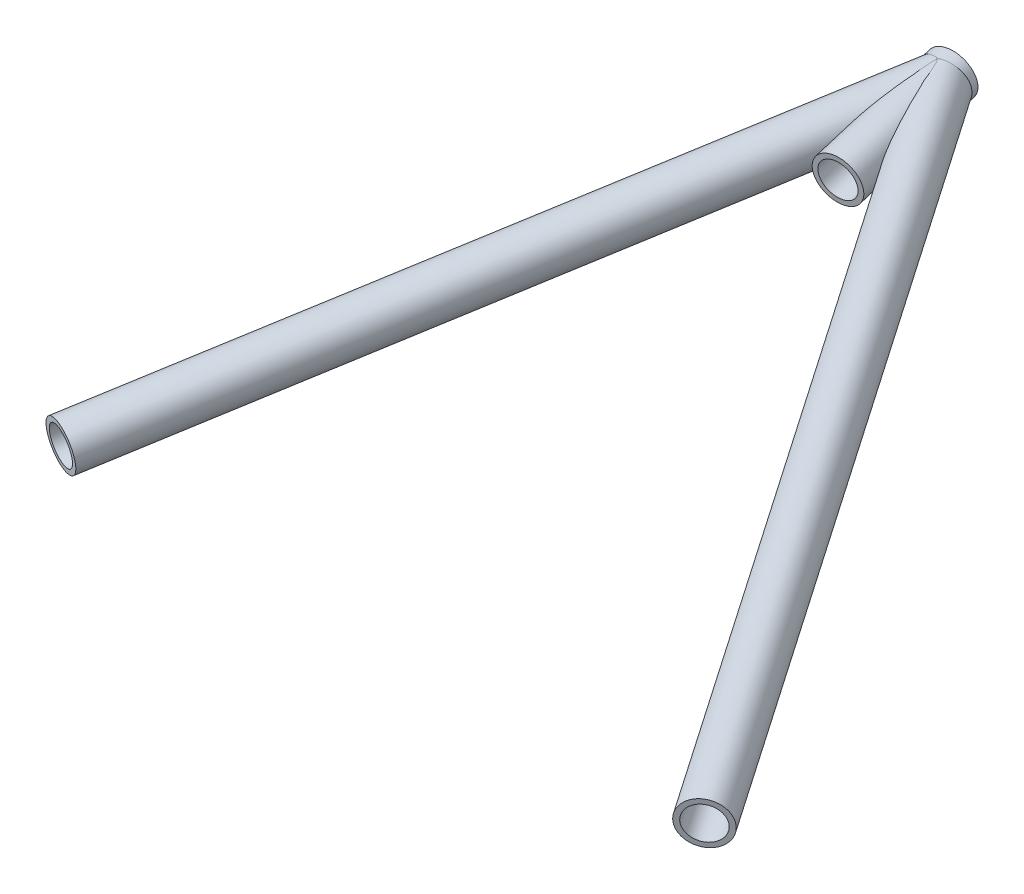
ISO-10303-21;
HEADER;
FILE_DESCRIPTION(('STEP AP214'),'2;1');
FILE_NAME('part.step','',(''),(''),'','','');
FILE_SCHEMA(('AUTOMOTIVE_DESIGN { 1 0 10303 214 1 1 1 1 }'));
ENDSEC;
DATA;
#1=APPLICATION_CONTEXT('core data for automotive mechanical design processes');
#2=APPLICATION_PROTOCOL_DEFINITION('international standard','automotive_design',2000,#1);
#3=PRODUCT_CONTEXT('',#1,'mechanical');
#4=PRODUCT('Part','Part','',(#3));
#5=PRODUCT_RELATED_PRODUCT_CATEGORY('part','',(#4));
#6=PRODUCT_DEFINITION_FORMATION('','',#4);
#7=PRODUCT_DEFINITION_CONTEXT('part definition',#1,'design');
#8=PRODUCT_DEFINITION('design','',#6,#7);
#9=PRODUCT_DEFINITION_SHAPE('','',#8);
#10=(LENGTH_UNIT() NAMED_UNIT(*) SI_UNIT(.MILLI.,.METRE.));
#11=(NAMED_UNIT(*) PLANE_ANGLE_UNIT() SI_UNIT($,.RADIAN.));
#12=(NAMED_UNIT(*) SI_UNIT($,.STERADIAN.) SOLID_ANGLE_UNIT());
#13=UNCERTAINTY_MEASURE_WITH_UNIT(LENGTH_MEASURE(1.E-05),#10,'distance_accuracy_value','');
#14=(GEOMETRIC_REPRESENTATION_CONTEXT(3) GLOBAL_UNCERTAINTY_ASSIGNED_CONTEXT((#13)) GLOBAL_UNIT_ASSIGNED_CONTEXT((#10,
#11,#12)) REPRESENTATION_CONTEXT('',''));
#15=CARTESIAN_POINT('',(0.,0.,0.));
#16=DIRECTION('',(0.,0.,1.));
#17=DIRECTION('',(1.,0.,0.));
#18=AXIS2_PLACEMENT_3D('',#15,#16,#17);
#19=CARTESIAN_POINT('',(4.04397858951078,301.981612494775,-650.872201759845));
#20=DIRECTION('',(0.537160814672258,-0.118768279923982,0.835076256915819));
#21=DIRECTION('',(0.841029061630512,0.,-0.540989942136544));
#22=AXIS2_PLACEMENT_3D('',#19,#20,#21);
#23=CYLINDRICAL_SURFACE('',#22,7.41679999999999);
#24=CARTESIAN_POINT('',(181.199371486471,262.811887676953,-375.464431215176));
#25=DIRECTION('',(-0.537160814672258,0.118768279923982,-0.835076256915819));
#26=DIRECTION('',(-0.841029061630512,0.,0.540989942136544));
#27=AXIS2_PLACEMENT_3D('',#24,#25,#26);
#28=CIRCLE('',#27,7.41679999999999);
#29=CARTESIAN_POINT('',(174.96162714217,262.811887676953,-371.452017012338));
#30=VERTEX_POINT('',#29);
#31=EDGE_CURVE('E107',#30,#30,#28,.T.);
#32=ORIENTED_EDGE('',*,*,#31,.F.);
#33=EDGE_LOOP('',(#32));
#34=FACE_BOUND('',#33,.T.);
#35=CARTESIAN_POINT('',(13.8206980198047,301.199131769866,-649.382885405639));
#36=CARTESIAN_POINT('',(13.8107554513525,301.004834071272,-649.398341630116));
#37=CARTESIAN_POINT('',(13.7955562754114,300.81031650493,-649.407729645231));
#38=CARTESIAN_POINT('',(13.7549430406658,300.42207729142,-649.414063919288));
#39=CARTESIAN_POINT('',(13.7295253039259,300.228355956228,-649.411005694874));
#40=CARTESIAN_POINT('',(13.668941958217,299.842741117412,-649.392047785591));
#41=CARTESIAN_POINT('',(13.6337601344558,299.650851208262,-649.376126655073));
#42=CARTESIAN_POINT('',(13.5544167889339,299.270537861153,-649.330981707171));
#43=CARTESIAN_POINT('',(13.5102560930672,299.082114106107,-649.301759112976));
#44=CARTESIAN_POINT('',(13.4138733302478,298.709728999547,-649.229479511083));
#45=CARTESIAN_POINT('',(13.3616395128709,298.525774612171,-649.18640223751));
#46=CARTESIAN_POINT('',(13.2504182639717,298.163900555168,-649.085932035394));
#47=CARTESIAN_POINT('',(13.1914306445094,297.985981053655,-649.028538708421));
#48=CARTESIAN_POINT('',(13.0683029136179,297.637614486215,-648.899045587752));
#49=CARTESIAN_POINT('',(13.0041674368784,297.467160907693,-648.826958934604));
#50=CARTESIAN_POINT('',(12.8725227679249,297.134801922059,-648.667725156594));
#51=CARTESIAN_POINT('',(12.8050137756413,296.97289600954,-648.580578923483));
#52=CARTESIAN_POINT('',(12.6712778858714,296.664743370898,-648.394730859944));
#53=CARTESIAN_POINT('',(12.6050995287082,296.518135582986,-648.296592926979));
#54=CARTESIAN_POINT('',(12.4735188770187,296.234788709822,-648.086519826771));
#55=CARTESIAN_POINT('',(12.4081165453744,296.09804915096,-647.974585322371));
#56=CARTESIAN_POINT('',(12.2801144376949,295.835180292405,-647.737583976231));
#57=CARTESIAN_POINT('',(12.2175132854605,295.709045755163,-647.612523686415));
#58=CARTESIAN_POINT('',(12.0969252721962,295.467697872211,-647.350245684631));
#59=CARTESIAN_POINT('',(12.0389382973799,295.352484257176,-647.213028272638));
#60=CARTESIAN_POINT('',(11.9324335470402,295.139664175803,-646.936470775977));
#61=CARTESIAN_POINT('',(11.8835549379273,295.041413898014,-646.797762846696));
#62=CARTESIAN_POINT('',(11.7921268498346,294.854321863066,-646.512189866713));
#63=CARTESIAN_POINT('',(11.749577031769,294.765479601915,-646.365325253612));
#64=CARTESIAN_POINT('',(11.6713411448821,294.596699505589,-646.064830133391));
#65=CARTESIAN_POINT('',(11.6356551461025,294.516761761284,-645.911199557248));
#66=CARTESIAN_POINT('',(11.5713225100739,294.365118415464,-645.598512850049));
#67=CARTESIAN_POINT('',(11.542676759512,294.293413851486,-645.439456038454));
#68=CARTESIAN_POINT('',(11.4745160510541,294.10931638736,-645.002956586368));
#69=CARTESIAN_POINT('',(11.4416681524004,294.004065976785,-644.721438375182));
#70=CARTESIAN_POINT('',(11.3945133199791,293.811412551757,-644.150839365053));
#71=CARTESIAN_POINT('',(11.3802205709604,293.724023234418,-643.861752952508));
#72=CARTESIAN_POINT('',(11.3676547219348,293.563276507303,-643.278011118803));
#73=CARTESIAN_POINT('',(11.3694552757307,293.489985182082,-642.98333625847));
#74=CARTESIAN_POINT('',(11.3823925957435,293.3888363993,-642.539762543802));
#75=CARTESIAN_POINT('',(11.3884098657996,293.356587970583,-642.391661137573));
#76=CARTESIAN_POINT('',(11.4035636408006,293.294724262012,-642.095064628122));
#77=CARTESIAN_POINT('',(11.4127001587891,293.265108993171,-641.946569523257));
#78=CARTESIAN_POINT('',(11.4403698044794,293.190601887475,-641.557073858043));
#79=CARTESIAN_POINT('',(11.4612153441587,293.147638280028,-641.315868062194));
#80=CARTESIAN_POINT('',(11.5093306970782,293.067025227133,-640.833194783426));
#81=CARTESIAN_POINT('',(11.5366014187548,293.029376534349,-640.591727268312));
#82=CARTESIAN_POINT('',(11.5966888754498,292.958666974247,-640.108693173126));
#83=CARTESIAN_POINT('',(11.6295083776565,292.925608411092,-639.867126603915));
#84=CARTESIAN_POINT('',(11.6999325025681,292.863542897817,-639.384164978302));
#85=CARTESIAN_POINT('',(11.7375374294296,292.834536205476,-639.142769933785));
#86=CARTESIAN_POINT('',(11.8567176155296,292.752789672647,-638.417935731447));
#87=CARTESIAN_POINT('',(11.9445212330136,292.705473529726,-637.934902731619));
#88=CARTESIAN_POINT('',(12.1326343148112,292.622827087972,-636.970447999279));
#89=CARTESIAN_POINT('',(12.2329406090138,292.587493759263,-636.489025889979));
#90=CARTESIAN_POINT('',(12.4434551203037,292.527294617559,-635.52655714508));
#91=CARTESIAN_POINT('',(12.5536853842878,292.502452845113,-635.045513865994));
#92=CARTESIAN_POINT('',(12.7817206302941,292.462547858227,-634.084805767346));
#93=CARTESIAN_POINT('',(12.8995260389886,292.44748519513,-633.605141027024));
#94=CARTESIAN_POINT('',(13.1409306332033,292.426816810737,-632.64779594404));
#95=CARTESIAN_POINT('',(13.2645213897946,292.421197745922,-632.170113754379));
#96=CARTESIAN_POINT('',(13.516411328825,292.419392275018,-631.215990617712));
#97=CARTESIAN_POINT('',(13.644710369853,292.423205585859,-630.739549633888));
#98=CARTESIAN_POINT('',(13.8799214879243,292.438921486653,-629.879689729575));
#99=CARTESIAN_POINT('',(13.9861833788896,292.449121191468,-629.496060816082));
#100=CARTESIAN_POINT('',(14.2007054888001,292.47620739905,-628.729598275498));
#101=CARTESIAN_POINT('',(14.3089656961835,292.493093863141,-628.34676464382));
#102=CARTESIAN_POINT('',(14.527181983303,292.534033654852,-627.581654372033));
#103=CARTESIAN_POINT('',(14.6371392612564,292.558092288589,-627.199378355607));
#104=CARTESIAN_POINT('',(14.8583183251295,292.614010550068,-626.435763523539));
#105=CARTESIAN_POINT('',(14.9695400977045,292.645870095556,-626.054424698058));
#106=CARTESIAN_POINT('',(15.1934681731951,292.718425677554,-625.290930753791));
#107=CARTESIAN_POINT('',(15.3061791171078,292.759165074646,-624.908781078082));
#108=CARTESIAN_POINT('',(15.5321785094427,292.850545730505,-624.14584243431));
#109=CARTESIAN_POINT('',(15.6454669377502,292.901186646651,-623.76505341963));
#110=CARTESIAN_POINT('',(15.8721007346009,293.013877097843,-623.005654652564));
#111=CARTESIAN_POINT('',(15.9854458833566,293.075913284109,-622.627042879387));
#112=CARTESIAN_POINT('',(16.2118236607391,293.213601848852,-621.872253458813));
#113=CARTESIAN_POINT('',(16.3248563347035,293.289252133989,-621.496075446392));
#114=CARTESIAN_POINT('',(16.5515921171423,293.458463104374,-620.741782734479));
#115=CARTESIAN_POINT('',(16.6652820235684,293.552262430083,-620.363716146541));
#116=CARTESIAN_POINT('',(16.8344160155779,293.70970872819,-619.800378882576));
#117=CARTESIAN_POINT('',(16.8906245544052,293.765055586023,-619.613012969272));
#118=CARTESIAN_POINT('',(17.0023269865388,293.882234253498,-619.240106821692));
#119=CARTESIAN_POINT('',(17.0578209422926,293.944065492091,-619.054566428223));
#120=CARTESIAN_POINT('',(17.1670852341023,294.074465041865,-618.68838232145));
#121=CARTESIAN_POINT('',(17.2208687294875,294.142930974963,-618.507706319901));
#122=CARTESIAN_POINT('',(17.3271367827908,294.28877169691,-618.149461260528));
#123=CARTESIAN_POINT('',(17.3796207886469,294.366150195782,-617.97189353227));
#124=CARTESIAN_POINT('',(17.482512372118,294.531428066245,-617.621954618945));
#125=CARTESIAN_POINT('',(17.5329271368028,294.619285979742,-617.449566126145));
#126=CARTESIAN_POINT('',(17.6310090110018,294.808334415285,-617.111519135431));
#127=CARTESIAN_POINT('',(17.6786791994058,294.909509561864,-616.945853160278));
#128=CARTESIAN_POINT('',(17.7419666422167,295.061738881909,-616.72310511854));
#129=CARTESIAN_POINT('',(17.759353466723,295.105594297412,-616.661591108606));
#130=CARTESIAN_POINT('',(17.7933756239575,295.196144273666,-616.540464547363));
#131=CARTESIAN_POINT('',(17.810010846675,295.242839247707,-616.480852274781));
#132=CARTESIAN_POINT('',(17.8586398969455,295.387790959813,-616.305218120446));
#133=CARTESIAN_POINT('',(17.889297291488,295.490774719078,-616.192608681576));
#134=CARTESIAN_POINT('',(17.9457559422173,295.713076172394,-615.979799913186));
#135=CARTESIAN_POINT('',(17.9714873156819,295.832592586709,-615.879785212915));
#136=CARTESIAN_POINT('',(18.0149324382546,296.08834761998,-615.701817230984));
#137=CARTESIAN_POINT('',(18.0326766769216,296.224520079901,-615.623780486867));
#138=CARTESIAN_POINT('',(18.0532713499871,296.465259679969,-615.519174428041));
#139=CARTESIAN_POINT('',(18.0590784815077,296.565873714768,-615.48412352593));
#140=CARTESIAN_POINT('',(18.0650145600515,296.771609509962,-615.430816702519));
#141=CARTESIAN_POINT('',(18.06514822251,296.876727454234,-615.412546846214));
#142=CARTESIAN_POINT('',(18.0596581510476,297.088297350189,-615.393583851262));
#143=CARTESIAN_POINT('',(18.0540375303252,297.194748549787,-615.392881213575));
#144=CARTESIAN_POINT('',(18.0376013191163,297.406092593281,-615.407816483679));
#145=CARTESIAN_POINT('',(18.0267800123076,297.510983591185,-615.423472394217));
#146=CARTESIAN_POINT('',(17.995293644553,297.761197018921,-615.478399434762));
#147=CARTESIAN_POINT('',(17.9723978823233,297.904621186416,-615.524907597489));
#148=CARTESIAN_POINT('',(17.9204844891648,298.181797380469,-615.638627340268));
#149=CARTESIAN_POINT('',(17.8914507338475,298.315522660461,-615.705893669902));
#150=CARTESIAN_POINT('',(17.831831899052,298.562661933225,-615.84883407259));
#151=CARTESIAN_POINT('',(17.8015741533158,298.676840949428,-615.923351329644));
#152=CARTESIAN_POINT('',(17.7385619814726,298.898031036011,-616.08151271483));
#153=CARTESIAN_POINT('',(17.705805281707,299.005035408218,-616.165165185166));
#154=CARTESIAN_POINT('',(17.6384255783912,299.212926212544,-616.339497651891));
#155=CARTESIAN_POINT('',(17.6037983621071,299.313797646337,-616.43019373129));
#156=CARTESIAN_POINT('',(17.5332295445294,299.509942979958,-616.616839926111));
#157=CARTESIAN_POINT('',(17.4972884793303,299.60521912239,-616.712787906355));
#158=CARTESIAN_POINT('',(17.402011844582,299.848032293815,-616.969097192271));
#159=CARTESIAN_POINT('',(17.3418714017792,299.991708464573,-617.132811258027));
#160=CARTESIAN_POINT('',(17.2198687826283,300.268950021873,-617.468030104825));
#161=CARTESIAN_POINT('',(17.1580056476228,300.402509618419,-617.639539258707));
#162=CARTESIAN_POINT('',(17.0330107940299,300.66144519822,-617.988692736611));
#163=CARTESIAN_POINT('',(16.9698769014913,300.786805259946,-618.16634802919));
#164=CARTESIAN_POINT('',(16.8428163464518,301.030404837181,-618.526205098945));
#165=CARTESIAN_POINT('',(16.7788895915806,301.148643513455,-618.708407408408));
#166=CARTESIAN_POINT('',(16.6501444507932,301.379647789057,-619.077479229946));
#167=CARTESIAN_POINT('',(16.5853230720726,301.492378858725,-619.264369230985));
#168=CARTESIAN_POINT('',(16.4553318142732,301.712457973887,-619.641173919875));
#169=CARTESIAN_POINT('',(16.3901619212934,301.819805802861,-619.831088728981));
#170=CARTESIAN_POINT('',(16.2597043589025,302.029616469677,-620.213209066749));
#171=CARTESIAN_POINT('',(16.1944169449979,302.132085351623,-620.405411371882));
#172=CARTESIAN_POINT('',(16.0637573976099,302.332791384079,-620.791977506002));
#173=CARTESIAN_POINT('',(15.998385264511,302.431028553731,-620.986341325207));
#174=CARTESIAN_POINT('',(15.8371384322317,302.668660633039,-621.468113843943));
#175=CARTESIAN_POINT('',(15.7412689629418,302.805863377599,-621.756606207294));
#176=CARTESIAN_POINT('',(15.5497985233848,303.0731252564,-622.336980071238));
#177=CARTESIAN_POINT('',(15.4541975712456,303.203183918835,-622.628861794131));
#178=CARTESIAN_POINT('',(15.2634601676564,303.456980081537,-623.215595364652));
#179=CARTESIAN_POINT('',(15.1683238305466,303.580716090362,-623.5104478936));
#180=CARTESIAN_POINT('',(14.9787344960356,303.82246003223,-624.102713588053));
#181=CARTESIAN_POINT('',(14.8842815198407,303.940467788154,-624.4001268324));
#182=CARTESIAN_POINT('',(14.601895243172,304.287085701375,-625.2968746333));
#183=CARTESIAN_POINT('',(14.4152754692229,304.507842587375,-625.899670861687));
#184=CARTESIAN_POINT('',(14.0471881546865,304.931246085693,-627.113001627444));
#185=CARTESIAN_POINT('',(13.8657198926076,305.133895242701,-627.723535063688));
#186=CARTESIAN_POINT('',(13.5104641592953,305.522084755134,-628.949633288493));
#187=CARTESIAN_POINT('',(13.3366514831961,305.707683844804,-629.565172190729));
#188=CARTESIAN_POINT('',(12.9984583368034,306.063361492773,-630.803410894434));
#189=CARTESIAN_POINT('',(12.834079141559,306.233437954825,-631.426111650323));
#190=CARTESIAN_POINT('',(12.5973519207687,306.476547585471,-632.365201393126));
#191=CARTESIAN_POINT('',(12.5201370642277,306.555528816983,-632.678835175192));
#192=CARTESIAN_POINT('',(12.3695231987774,306.709380683531,-633.30801811573));
#193=CARTESIAN_POINT('',(12.29612408388,306.784251432746,-633.623567220727));
#194=CARTESIAN_POINT('',(12.1538450344398,306.929621366978,-634.256611116682));
#195=CARTESIAN_POINT('',(12.0849641033075,307.000121515841,-634.574105461563));
#196=CARTESIAN_POINT('',(11.9525591569464,307.136383272681,-635.211211738377));
#197=CARTESIAN_POINT('',(11.8890348130101,307.202145171385,-635.530823539071));
#198=CARTESIAN_POINT('',(11.7936997071475,307.30189952318,-636.037793319201));
#199=CARTESIAN_POINT('',(11.7597609696554,307.337649887731,-636.224406297266));
#200=CARTESIAN_POINT('',(11.6943018581537,307.407209249287,-636.598413711423));
#201=CARTESIAN_POINT('',(11.6627814676325,307.441018259546,-636.785808142171));
#202=CARTESIAN_POINT('',(11.5722435545289,307.539291732322,-637.349284601614));
#203=CARTESIAN_POINT('',(11.5172619372174,307.600589485031,-637.72659357786));
#204=CARTESIAN_POINT('',(11.4208294893135,307.712744583423,-638.484400968268));
#205=CARTESIAN_POINT('',(11.3793746239635,307.763605040658,-638.864898396582));
#206=CARTESIAN_POINT('',(11.3135654477527,307.851909566596,-639.628930197575));
#207=CARTESIAN_POINT('',(11.2892054677399,307.889358081063,-640.012463520754));
#208=CARTESIAN_POINT('',(11.2664420771376,307.937188686062,-640.658936124305));
#209=CARTESIAN_POINT('',(11.2622365270215,307.952394438526,-640.921305562297));
#210=CARTESIAN_POINT('',(11.2655240690963,307.972445488695,-641.446453254083));
#211=CARTESIAN_POINT('',(11.2730181933755,307.977289872281,-641.709231541902));
#212=CARTESIAN_POINT('',(11.3013924323451,307.974082022274,-642.233529079733));
#213=CARTESIAN_POINT('',(11.3222460104897,307.966055307781,-642.49504979249));
#214=CARTESIAN_POINT('',(11.3788487055761,307.934064859867,-643.015509123865));
#215=CARTESIAN_POINT('',(11.4145913153083,307.910108085912,-643.274448819948));
#216=CARTESIAN_POINT('',(11.4897838349165,307.852103984059,-643.716302047748));
#217=CARTESIAN_POINT('',(11.5254834039723,307.82267095381,-643.900461252639));
#218=CARTESIAN_POINT('',(11.6050819454494,307.752332912932,-644.264755114554));
#219=CARTESIAN_POINT('',(11.6489783916898,307.711431434802,-644.444890992422));
#220=CARTESIAN_POINT('',(11.7444689809492,307.61700827392,-644.79960314473));
#221=CARTESIAN_POINT('',(11.7960572054311,307.563496276275,-644.974183569644));
#222=CARTESIAN_POINT('',(11.9059813439524,307.442933097652,-645.316430677527));
#223=CARTESIAN_POINT('',(11.9643172500652,307.37588193258,-645.484097368617));
#224=CARTESIAN_POINT('',(12.0866042238134,307.227342566793,-645.811968294007));
#225=CARTESIAN_POINT('',(12.1505832726029,307.145780119266,-645.972128527199));
#226=CARTESIAN_POINT('',(12.2820371901955,306.96839984021,-646.282840612164));
#227=CARTESIAN_POINT('',(12.3495121680977,306.872581563618,-646.433392163748));
#228=CARTESIAN_POINT('',(12.4859424828385,306.666997449703,-646.724103112909));
#229=CARTESIAN_POINT('',(12.5548988225317,306.557221899366,-646.864255164763));
#230=CARTESIAN_POINT('',(12.6921557089466,306.324505563358,-647.133499607498));
#231=CARTESIAN_POINT('',(12.7604562699759,306.20156506563,-647.262592240158));
#232=CARTESIAN_POINT('',(12.889747973434,305.952524131525,-647.500817212439));
#233=CARTESIAN_POINT('',(12.9509164180077,305.827244435488,-647.610713950574));
#234=CARTESIAN_POINT('',(13.0695572928337,305.567058551087,-647.820641144776));
#235=CARTESIAN_POINT('',(13.1270299287659,305.43215289931,-647.920672150058));
#236=CARTESIAN_POINT('',(13.2370612106326,305.153632416443,-648.110932552471));
#237=CARTESIAN_POINT('',(13.2896180912225,305.010014486893,-648.201158430258));
#238=CARTESIAN_POINT('',(13.3887472427961,304.71511339578,-648.371839176918));
#239=CARTESIAN_POINT('',(13.4353193034927,304.563829965136,-648.452293702452));
#240=CARTESIAN_POINT('',(13.524535097967,304.244139073096,-648.608626588527));
#241=CARTESIAN_POINT('',(13.5666995480357,304.075265652169,-648.683826573555));
#242=CARTESIAN_POINT('',(13.6423884635492,303.731151451199,-648.823247745801));
#243=CARTESIAN_POINT('',(13.675911845888,303.555909876085,-648.887467556381));
#244=CARTESIAN_POINT('',(13.7336536816471,303.20052872074,-649.004869438564));
#245=CARTESIAN_POINT('',(13.757883966705,303.020395683301,-649.058065505247));
#246=CARTESIAN_POINT('',(13.7966670940987,302.656288087719,-649.153477615197));
#247=CARTESIAN_POINT('',(13.8112231857635,302.472314840845,-649.195697342249));
#248=CARTESIAN_POINT('',(13.8301267934079,302.10749501039,-649.267936144824));
#249=CARTESIAN_POINT('',(13.8347806653411,301.926731783516,-649.298296856578));
#250=CARTESIAN_POINT('',(13.8347333734919,301.563754225291,-649.348516296471));
#251=CARTESIAN_POINT('',(13.8300321767305,301.381539888827,-649.368374987588));
#252=CARTESIAN_POINT('',(13.8206980198047,301.199131769866,-649.382885405639));
#253=B_SPLINE_CURVE_WITH_KNOTS('',3,(#35,#36,#37,#38,#39,#40,#41,#42,#43,#44,#45,#46,#47,#48,
#49,#50,#51,#52,#53,#54,#55,#56,#57,#58,#59,#60,#61,#62,#63,#64,#65,#66,#67,#68,#69,#70,#71,#72,
#73,#74,#75,#76,#77,#78,#79,#80,#81,#82,#83,#84,#85,#86,#87,#88,#89,#90,#91,#92,#93,#94,#95,#96,
#97,#98,#99,#100,#101,#102,#103,#104,#105,#106,#107,#108,#109,#110,#111,#112,#113,#114,#115,
#116,#117,#118,#119,#120,#121,#122,#123,#124,#125,#126,#127,#128,#129,#130,#131,#132,#133,#134,
#135,#136,#137,#138,#139,#140,#141,#142,#143,#144,#145,#146,#147,#148,#149,#150,#151,#152,#153,
#154,#155,#156,#157,#158,#159,#160,#161,#162,#163,#164,#165,#166,#167,#168,#169,#170,#171,#172,
#173,#174,#175,#176,#177,#178,#179,#180,#181,#182,#183,#184,#185,#186,#187,#188,#189,#190,#191,
#192,#193,#194,#195,#196,#197,#198,#199,#200,#201,#202,#203,#204,#205,#206,#207,#208,#209,#210,
#211,#212,#213,#214,#215,#216,#217,#218,#219,#220,#221,#222,#223,#224,#225,#226,#227,#228,#229,
#230,#231,#232,#233,#234,#235,#236,#237,#238,#239,#240,#241,#242,#243,#244,#245,#246,#247,#248,
#249,#250,#251,#252),.UNSPECIFIED.,.T.,.F.,(4,2,2,2,2,2,2,2,2,2,2,2,2,2,2,2,2,2,2,2,2,2,2,2,2,2,
2,2,2,2,2,2,2,2,2,2,2,2,2,2,2,2,2,2,2,2,2,2,2,2,2,2,2,2,2,2,2,2,2,2,2,2,2,2,2,2,2,2,2,2,2,2,2,2,
2,2,2,2,2,2,2,2,2,2,2,2,2,2,2,2,2,2,2,2,2,2,2,2,2,2,2,2,2,2,2,2,2,2,4),(0.,0.585339332463419,
1.17088953320785,1.75741801079551,2.34389256274812,2.93122890956883,3.51858160434436,
4.10541130411829,4.69220626678487,5.25673706545461,5.82124075232614,6.38546398728098,
6.94967330407462,7.47970328088201,8.00970484936606,8.53971182594662,9.06978552031288,
9.97521162470265,10.8813294882015,11.7915964738424,12.246627676682,12.7016607823286,
13.4391449064683,14.176733363816,14.9146907489488,15.6526950613327,17.1319243797473,
18.6107793928655,20.0930049341612,21.575314035544,23.0555269126565,24.5356953685884,
25.7302513401707,26.9248004024914,28.1202354188921,29.3156578309477,30.5170537927015,
31.7184081901135,32.9183641552208,34.1181357692345,35.3349111777392,35.9447071941789,
36.5544495537494,37.1559488705621,37.757699483775,38.3571438710064,38.9559021404522,
39.1883970864298,39.4209259527903,39.8867578032123,40.3587747928442,40.8289743294252,
41.1476765000444,41.4661137800099,41.7843788691335,42.1029945814495,42.5579039477143,
43.0140235411354,43.4323883886933,43.8511385300295,44.2708746464214,44.6904413672434,
45.3678184095239,46.0455802492697,46.724621296827,47.4037422114612,48.0866834263252,
48.7696520876321,49.4517514083579,50.1338476432255,51.1343261456485,52.1348706419628,
53.1356500758229,54.1364604340277,56.1416436428268,58.1465446174266,60.1442575501291,
62.1422398650409,63.1397435019326,64.1372194167854,65.1344745703234,66.1316684826034,
66.7106855101157,67.2896985839679,68.4479306857602,69.60581699377,70.7633191319334,
71.5514791759963,72.3397087516265,73.126377462019,73.912702721165,74.4818547323608,
75.0508316262585,75.6193729516979,76.1879136092755,76.7594515460929,77.3310073299173,
77.9029630650519,78.4749062929343,79.006893965938,79.5388520069978,80.0710003570111,
80.6031673998752,81.1713560526085,81.7396158897945,82.3071498181145,82.8744930289703,
83.4240119937709,83.9735328957724),.UNSPECIFIED.);
#254=CARTESIAN_POINT('',(13.8206980198047,301.199131769866,-649.382885405639));
#255=VERTEX_POINT('',#254);
#256=EDGE_CURVE('E81',#255,#255,#253,.T.);
#257=ORIENTED_EDGE('',*,*,#256,.T.);
#258=EDGE_LOOP('',(#257));
#259=FACE_BOUND('',#258,.T.);
#260=ADVANCED_FACE('F63',(#34,#259),#23,.F.);
#261=CARTESIAN_POINT('',(10.1712188766484,294.809656352147,-601.770063603224));
#262=DIRECTION('',(-0.122544805742753,0.143439122852553,-0.982042763132422));
#263=DIRECTION('',(0.,0.989500647349858,0.144528436282319));
#264=AXIS2_PLACEMENT_3D('',#261,#262,#263);
#265=CYLINDRICAL_SURFACE('',#264,9.52500000000001);
#266=ORIENTED_EDGE('',*,*,#256,.F.);
#267=EDGE_LOOP('',(#266));
#268=FACE_BOUND('',#267,.T.);
#269=CARTESIAN_POINT('',(4.0439785895108,301.981612494775,-650.872201759845));
#270=DIRECTION('',(0.941060120574561,0.0559957790365611,-0.333572064469255));
#271=DIRECTION('',(0.338160058557685,-0.134405510478131,0.931441320507833));
#272=AXIS2_PLACEMENT_3D('',#269,#270,#271);
#273=ELLIPSE('',#272,43.2380682628042,9.525);
#274=CARTESIAN_POINT('',(4.11372881922309,292.558120131745,-652.257319657128));
#275=VERTEX_POINT('',#274);
#276=CARTESIAN_POINT('',(3.97422835979851,311.405104857805,-649.487083862563));
#277=VERTEX_POINT('',#276);
#278=EDGE_CURVE('E72',#275,#277,#273,.F.);
#279=ORIENTED_EDGE('',*,*,#278,.T.);
#280=CARTESIAN_POINT('',(4.0439785895108,301.981612494775,-650.872201759845));
#281=DIRECTION('',(0.338160058557685,-0.134405510478131,0.931441320507833));
#282=DIRECTION('',(0.941060120574561,0.0559957790365611,-0.333572064469255));
#283=AXIS2_PLACEMENT_3D('',#280,#281,#282);
#284=ELLIPSE('',#283,9.76488439111884,9.525);
#285=EDGE_CURVE('E13',#277,#275,#284,.F.);
#286=ORIENTED_EDGE('',*,*,#285,.T.);
#287=EDGE_LOOP('',(#279,#286));
#288=FACE_BOUND('',#287,.T.);
#289=ADVANCED_FACE('F79',(#268,#288),#265,.F.);
#290=CARTESIAN_POINT('',(4.04397858951078,301.981612494775,-650.872201759845));
#291=DIRECTION('',(0.537160814672258,-0.118768279923982,0.835076256915819));
#292=DIRECTION('',(0.841029061630512,0.,-0.540989942136544));
#293=AXIS2_PLACEMENT_3D('',#290,#291,#292);
#294=CYLINDRICAL_SURFACE('',#293,9.525);
#295=CARTESIAN_POINT('',(181.199371486471,262.811887676953,-375.464431215176));
#296=DIRECTION('',(-0.537160814672258,0.118768279923982,-0.835076256915819));
#297=DIRECTION('',(-0.841029061630512,0.,0.540989942136544));
#298=AXIS2_PLACEMENT_3D('',#295,#296,#297);
#299=CIRCLE('',#298,9.525);
#300=CARTESIAN_POINT('',(173.18856967444,262.811887676953,-370.311502016325));
#301=VERTEX_POINT('',#300);
#302=EDGE_CURVE('E67',#301,#301,#299,.T.);
#303=ORIENTED_EDGE('',*,*,#302,.T.);
#304=EDGE_LOOP('',(#303));
#305=FACE_BOUND('',#304,.T.);
#306=ORIENTED_EDGE('',*,*,#278,.F.);
#307=ORIENTED_EDGE('',*,*,#285,.F.);
#308=EDGE_LOOP('',(#306,#307));
#309=FACE_BOUND('',#308,.T.);
#310=ADVANCED_FACE('F65',(#305,#309),#294,.T.);
#311=CARTESIAN_POINT('',(181.199371486471,262.811887676954,-375.464431215176));
#312=DIRECTION('',(-0.537160814672258,0.118768279923982,-0.835076256915819));
#313=DIRECTION('',(-0.841029061630512,0.,0.540989942136544));
#314=AXIS2_PLACEMENT_3D('',#311,#312,#313);
#315=PLANE('',#314);
#316=ORIENTED_EDGE('',*,*,#31,.T.);
#317=EDGE_LOOP('',(#316));
#318=FACE_BOUND('',#317,.T.);
#319=ORIENTED_EDGE('',*,*,#302,.F.);
#320=EDGE_LOOP('',(#319));
#321=FACE_BOUND('',#320,.T.);
#322=ADVANCED_FACE('F84',(#318,#321),#315,.F.);
#323=CLOSED_SHELL('',(#260,#289,#310,#322));
#324=MANIFOLD_SOLID_BREP('B2',#323);
#325=CARTESIAN_POINT('',(-99.9999999999998,256.434476218686,-346.236762223122));
#326=DIRECTION('',(0.320018024842971,0.140093687168908,-0.936996383446075));
#327=DIRECTION('',(-0.946328839633178,0.,-0.323205394878431));
#328=AXIS2_PLACEMENT_3D('',#325,#326,#327);
#329=CYLINDRICAL_SURFACE('',#328,7.41679999999999);
#330=CARTESIAN_POINT('',(-88.7993691304958,261.337755269598,-379.031635643735));
#331=DIRECTION('',(0.320018024842971,0.140093687168908,-0.936996383446075));
#332=DIRECTION('',(-0.946328839633178,0.,-0.323205394878431));
#333=AXIS2_PLACEMENT_3D('',#330,#331,#332);
#334=CIRCLE('',#333,7.41679999999999);
#335=CARTESIAN_POINT('',(-95.8181008682872,261.337755269598,-381.428785416469));
#336=VERTEX_POINT('',#335);
#337=EDGE_CURVE('E189',#336,#336,#334,.T.);
#338=ORIENTED_EDGE('',*,*,#337,.F.);
#339=EDGE_LOOP('',(#338));
#340=FACE_BOUND('',#339,.T.);
#341=CARTESIAN_POINT('',(-5.07233249655578,301.063359139598,-647.127746651762));
#342=CARTESIAN_POINT('',(-5.08057709325055,301.259684415892,-647.103603558293));
#343=CARTESIAN_POINT('',(-5.08203640500365,301.455785733625,-647.074784010796));
#344=CARTESIAN_POINT('',(-5.07135862024191,301.846136891764,-647.007992991406));
#345=CARTESIAN_POINT('',(-5.05921329627936,302.040385540083,-646.97001599242));
#346=CARTESIAN_POINT('',(-5.02144713438112,302.426026247894,-646.884889557591));
#347=CARTESIAN_POINT('',(-4.99579487567958,302.617410572089,-646.837718896648));
#348=CARTESIAN_POINT('',(-4.93136465241606,302.995432593523,-646.734215605233));
#349=CARTESIAN_POINT('',(-4.89258674934015,303.182070312993,-646.677883017681));
#350=CARTESIAN_POINT('',(-4.8024740737869,303.549198873559,-646.555875128191));
#351=CARTESIAN_POINT('',(-4.75113726125613,303.729688710569,-646.490198309114));
#352=CARTESIAN_POINT('',(-4.63671057913948,304.083039328403,-646.349221201359));
#353=CARTESIAN_POINT('',(-4.57362019373789,304.255899773993,-646.273920490374));
#354=CARTESIAN_POINT('',(-4.43679396856856,304.592390178724,-646.113373524931));
#355=CARTESIAN_POINT('',(-4.36306567613499,304.756026568594,-646.028134329744));
#356=CARTESIAN_POINT('',(-4.20627168779448,305.072724431992,-645.847227188151));
#357=CARTESIAN_POINT('',(-4.12320636907637,305.225786332294,-645.751559663024));
#358=CARTESIAN_POINT('',(-3.95149295267558,305.516342995383,-645.55179636062));
#359=CARTESIAN_POINT('',(-3.86302853578585,305.654124785235,-645.447960480173));
#360=CARTESIAN_POINT('',(-3.68060925343506,305.917008445376,-645.229595139121));
#361=CARTESIAN_POINT('',(-3.58665453171492,306.042110647393,-645.115065958428));
#362=CARTESIAN_POINT('',(-3.39542338505047,306.27846673069,-644.875253095189));
#363=CARTESIAN_POINT('',(-3.29814977672976,306.389731999828,-644.749978401679));
#364=CARTESIAN_POINT('',(-3.10247561975599,306.59774594542,-644.488722268227));
#365=CARTESIAN_POINT('',(-3.00407515667007,306.694495716337,-644.352741636689));
#366=CARTESIAN_POINT('',(-2.81570561627911,306.866473026161,-644.081052702542));
#367=CARTESIAN_POINT('',(-2.72565308991791,306.942765311368,-643.946074150318));
#368=CARTESIAN_POINT('',(-2.54822274468801,307.08268046345,-643.668033331305));
#369=CARTESIAN_POINT('',(-2.46084504760579,307.146302754177,-643.524970697284));
#370=CARTESIAN_POINT('',(-2.29021761642912,307.261302631084,-643.231707806066));
#371=CARTESIAN_POINT('',(-2.20696701518271,307.312682798188,-643.081509061351));
#372=CARTESIAN_POINT('',(-2.04563305894732,307.403986405838,-642.77498828784));
#373=CARTESIAN_POINT('',(-1.96755044348384,307.443908209436,-642.618665387767));
#374=CARTESIAN_POINT('',(-1.78654907875723,307.527447898765,-642.236078101194));
#375=CARTESIAN_POINT('',(-1.6865086420538,307.565918209161,-642.007319750769));
#376=CARTESIAN_POINT('',(-1.49876999601676,307.625202139719,-641.542576372038));
#377=CARTESIAN_POINT('',(-1.41107773593778,307.646007273053,-641.306587926543));
#378=CARTESIAN_POINT('',(-1.24744027952672,307.673064758457,-640.828964741442));
#379=CARTESIAN_POINT('',(-1.17153429595453,307.679269464792,-640.587314107786));
#380=CARTESIAN_POINT('',(-1.03088207392797,307.679703494234,-640.100889694105));
#381=CARTESIAN_POINT('',(-0.96613407938328,307.673934703647,-639.85611641206));
#382=CARTESIAN_POINT('',(-0.825512318801068,307.648940879439,-639.278006492234));
#383=CARTESIAN_POINT('',(-0.753756240883387,307.625690912149,-638.943851721239));
#384=CARTESIAN_POINT('',(-0.625399792754563,307.565642626508,-638.273786388398));
#385=CARTESIAN_POINT('',(-0.568807624831217,307.52883700124,-637.937874976112));
#386=CARTESIAN_POINT('',(-0.468045634688803,307.444546447313,-637.264886915072));
#387=CARTESIAN_POINT('',(-0.423900640837123,307.39704050938,-636.92780927619));
#388=CARTESIAN_POINT('',(-0.345954491284497,307.293478096382,-636.253872695781));
#389=CARTESIAN_POINT('',(-0.312151445574622,307.237423186465,-635.917013725534));
#390=CARTESIAN_POINT('',(-0.252898224421249,307.11785586592,-635.241898967132));
#391=CARTESIAN_POINT('',(-0.227497057313588,307.054302535771,-634.903646245573));
#392=CARTESIAN_POINT('',(-0.183839039798984,306.921014872539,-634.227901001792));
#393=CARTESIAN_POINT('',(-0.165582432592793,306.851280329147,-633.890408505838));
#394=CARTESIAN_POINT('',(-0.135050640687783,306.706417550935,-633.216723443075));
#395=CARTESIAN_POINT('',(-0.122768667616517,306.631295549267,-632.880529833553));
#396=CARTESIAN_POINT('',(-0.103210044484637,306.476060473594,-632.209147988915));
#397=CARTESIAN_POINT('',(-0.095933537177399,306.395947257314,-631.873959782742));
#398=CARTESIAN_POINT('',(-0.0838812674295373,306.203353913493,-631.092273780297));
#399=CARTESIAN_POINT('',(-0.080766244426857,306.089040063292,-630.646201966159));
#400=CARTESIAN_POINT('',(-0.0806417462217565,305.852476248173,-629.756164046485));
#401=CARTESIAN_POINT('',(-0.0836324419168874,305.730226061213,-629.312198000237));
#402=CARTESIAN_POINT('',(-0.0946105028134257,305.477826146868,-628.426340776179));
#403=CARTESIAN_POINT('',(-0.102600371379306,305.347672491279,-627.984450749708));
#404=CARTESIAN_POINT('',(-0.122699666729587,305.079380266455,-627.103203486392));
#405=CARTESIAN_POINT('',(-0.134809031650453,304.941241817156,-626.663846211611));
#406=CARTESIAN_POINT('',(-0.162384546233164,304.657222018021,-625.78983872471));
#407=CARTESIAN_POINT('',(-0.177836015468198,304.511376574517,-625.355176389959));
#408=CARTESIAN_POINT('',(-0.211558723837332,304.210803163783,-624.489026811751));
#409=CARTESIAN_POINT('',(-0.229830033028942,304.056074975925,-624.057539647459));
#410=CARTESIAN_POINT('',(-0.268707470233989,303.736952752085,-623.19848591057));
#411=CARTESIAN_POINT('',(-0.289312486723988,303.572563335457,-622.77091757549));
#412=CARTESIAN_POINT('',(-0.332452573681699,303.232863164096,-621.920257502998));
#413=CARTESIAN_POINT('',(-0.354987511611362,303.057553159564,-621.497165460413));
#414=CARTESIAN_POINT('',(-0.401640732662212,302.6941444763,-620.656059322027));
#415=CARTESIAN_POINT('',(-0.425760632780465,302.506032729885,-620.23805094433));
#416=CARTESIAN_POINT('',(-0.475212888592688,302.11475569336,-619.40895533652));
#417=CARTESIAN_POINT('',(-0.500545676540207,301.91158502214,-618.99787064552));
#418=CARTESIAN_POINT('',(-0.539183096088928,301.592708674569,-618.388007268301));
#419=CARTESIAN_POINT('',(-0.552185836513586,301.48391331704,-618.185589416771));
#420=CARTESIAN_POINT('',(-0.578335765859221,301.261064919514,-617.783684723243));
#421=CARTESIAN_POINT('',(-0.591482945022743,301.147012233029,-617.584197685357));
#422=CARTESIAN_POINT('',(-0.617846293532403,300.912977265552,-617.188906853005));
#423=CARTESIAN_POINT('',(-0.631062410604791,300.792999019019,-616.993100674457));
#424=CARTESIAN_POINT('',(-0.657487226214965,300.546099148357,-616.605934315117));
#425=CARTESIAN_POINT('',(-0.670695925554169,300.419178540573,-616.41457348935));
#426=CARTESIAN_POINT('',(-0.697102040669243,300.15610067695,-616.036030459765));
#427=CARTESIAN_POINT('',(-0.710298551258397,300.019878646626,-615.848892937532));
#428=CARTESIAN_POINT('',(-0.736429027852739,299.737286086606,-615.482120378254));
#429=CARTESIAN_POINT('',(-0.749362786625791,299.590907920059,-615.302491153282));
#430=CARTESIAN_POINT('',(-0.774662756569135,299.286492960399,-614.954679300562));
#431=CARTESIAN_POINT('',(-0.787031266306935,299.128511782671,-614.786448658708));
#432=CARTESIAN_POINT('',(-0.810869264449682,298.797468795983,-614.465672983777));
#433=CARTESIAN_POINT('',(-0.822340360794878,298.624435189805,-614.313099736131));
#434=CARTESIAN_POINT('',(-0.841681497680955,298.294366406668,-614.059120735717));
#435=CARTESIAN_POINT('',(-0.849820207480909,298.140629626021,-613.953514020421));
#436=CARTESIAN_POINT('',(-0.864462134290238,297.819038554653,-613.766351424907));
#437=CARTESIAN_POINT('',(-0.870970626176602,297.651232204399,-613.68471782334));
#438=CARTESIAN_POINT('',(-0.879476761068998,297.366989173721,-613.58132162412));
#439=CARTESIAN_POINT('',(-0.882251929914337,297.254628649392,-613.548583392556));
#440=CARTESIAN_POINT('',(-0.886496270940558,297.026084366279,-613.501196909597));
#441=CARTESIAN_POINT('',(-0.887966944270156,296.909905161991,-613.486527857507));
#442=CARTESIAN_POINT('',(-0.889366213265536,296.675674492161,-613.478295622157));
#443=CARTESIAN_POINT('',(-0.889281542735407,296.557615509904,-613.484913611051));
#444=CARTESIAN_POINT('',(-0.887456264493678,296.32493347832,-613.520516487409));
#445=CARTESIAN_POINT('',(-0.885715725336811,296.210310286949,-613.549500448889));
#446=CARTESIAN_POINT('',(-0.880992119530646,295.999762177466,-613.623550895921));
#447=CARTESIAN_POINT('',(-0.878155256589638,295.903126634375,-613.666656723881));
#448=CARTESIAN_POINT('',(-0.871485767549604,295.717083648511,-613.766196603967));
#449=CARTESIAN_POINT('',(-0.867652592308501,295.627680227645,-613.822638004758));
#450=CARTESIAN_POINT('',(-0.856265018596798,295.396613217452,-613.988956532116));
#451=CARTESIAN_POINT('',(-0.847981708606486,295.262072613784,-614.108618323289));
#452=CARTESIAN_POINT('',(-0.830053978715324,295.01233016625,-614.366583666374));
#453=CARTESIAN_POINT('',(-0.820404933194729,294.897197083746,-614.504950495879));
#454=CARTESIAN_POINT('',(-0.800225549555821,294.682071858599,-614.794327028293));
#455=CARTESIAN_POINT('',(-0.789689234319899,294.582197697294,-614.945422481));
#456=CARTESIAN_POINT('',(-0.768116619668257,294.395319572888,-615.255423671112));
#457=CARTESIAN_POINT('',(-0.757079788049734,294.308329749782,-615.414337738105));
#458=CARTESIAN_POINT('',(-0.734691590113129,294.144645977472,-615.737782811623));
#459=CARTESIAN_POINT('',(-0.723339529395906,294.067977365988,-615.902326440774));
#460=CARTESIAN_POINT('',(-0.700483971211482,293.923345861569,-616.235048623102));
#461=CARTESIAN_POINT('',(-0.6889805542241,293.855378533081,-616.403225272802));
#462=CARTESIAN_POINT('',(-0.667104015186873,293.733372995263,-616.724695989112));
#463=CARTESIAN_POINT('',(-0.656737559901673,293.678621260343,-616.877722086228));
#464=CARTESIAN_POINT('',(-0.635995622382079,293.574153005478,-617.185488231589));
#465=CARTESIAN_POINT('',(-0.625620139411771,293.524436944408,-617.340228434607));
#466=CARTESIAN_POINT('',(-0.594526788032695,293.38182362548,-617.806604015103));
#467=CARTESIAN_POINT('',(-0.573851163719084,293.295510657627,-618.120260277375));
#468=CARTESIAN_POINT('',(-0.532790575159813,293.136577980052,-618.751633002405));
#469=CARTESIAN_POINT('',(-0.512406273540107,293.063985949573,-619.069356320437));
#470=CARTESIAN_POINT('',(-0.47212077952181,292.930175678286,-619.707238565805));
#471=CARTESIAN_POINT('',(-0.452219642882903,292.868958744849,-620.027397768707));
#472=CARTESIAN_POINT('',(-0.412947862475075,292.755846620098,-620.670813633492));
#473=CARTESIAN_POINT('',(-0.393579902376919,292.703993129003,-620.994077710864));
#474=CARTESIAN_POINT('',(-0.355584046295141,292.608577102898,-621.641877183259));
#475=CARTESIAN_POINT('',(-0.336956187578397,292.565014984972,-621.9664126414));
#476=CARTESIAN_POINT('',(-0.300582647433496,292.485205688381,-622.616006755206));
#477=CARTESIAN_POINT('',(-0.282835880505192,292.448949331595,-622.941064230737));
#478=CARTESIAN_POINT('',(-0.248321317533621,292.382892527736,-623.591886536411));
#479=CARTESIAN_POINT('',(-0.231553540421746,292.353092205478,-623.917651380107));
#480=CARTESIAN_POINT('',(-0.190925394152259,292.285717555019,-624.734633848367));
#481=CARTESIAN_POINT('',(-0.167767550255649,292.251835505767,-625.226192610708));
#482=CARTESIAN_POINT('',(-0.124469385265978,292.195689999955,-626.210112865871));
#483=CARTESIAN_POINT('',(-0.104329200882271,292.173427069663,-626.702474394039));
#484=CARTESIAN_POINT('',(-0.0676622118545903,292.139414646949,-627.688036030488));
#485=CARTESIAN_POINT('',(-0.0511379376948768,292.127672499505,-628.181236484155));
#486=CARTESIAN_POINT('',(-0.0224732399931386,292.11399240435,-629.16788754969));
#487=CARTESIAN_POINT('',(-0.0103327150481694,292.112054229844,-629.661338155507));
#488=CARTESIAN_POINT('',(0.00858025502221795,292.117553391305,-630.646500967238));
#489=CARTESIAN_POINT('',(0.0153720164887033,292.124956737109,-631.138212984821));
#490=CARTESIAN_POINT('',(0.0224517292745807,292.148971783607,-632.121486765106));
#491=CARTESIAN_POINT('',(0.0227394039515545,292.165583875952,-632.613048520528));
#492=CARTESIAN_POINT('',(0.0152282672270341,292.208236066461,-633.595421161707));
#493=CARTESIAN_POINT('',(0.00743422806372425,292.234270594786,-634.086232319393));
#494=CARTESIAN_POINT('',(-0.0183309446386126,292.296423122996,-635.066923183498));
#495=CARTESIAN_POINT('',(-0.0363009387044925,292.332539993659,-635.556802988046));
#496=CARTESIAN_POINT('',(-0.0808648149254558,292.408602697456,-636.446765164883));
#497=CARTESIAN_POINT('',(-0.105319310925539,292.446683711131,-636.847111065668));
#498=CARTESIAN_POINT('',(-0.165096239741603,292.531649358345,-637.646148906052));
#499=CARTESIAN_POINT('',(-0.200420213812021,292.578535240016,-638.044840602961));
#500=CARTESIAN_POINT('',(-0.28467432901911,292.682893475365,-638.839691767374));
#501=CARTESIAN_POINT('',(-0.33361292014118,292.740372396166,-639.235849505446));
#502=CARTESIAN_POINT('',(-0.448589471378676,292.868529722619,-640.023533337893));
#503=CARTESIAN_POINT('',(-0.514622050279581,292.939203972413,-640.415060849383));
#504=CARTESIAN_POINT('',(-0.643401834937058,293.072179702705,-641.065271937604));
#505=CARTESIAN_POINT('',(-0.700332295734868,293.129822811842,-641.32605055286));
#506=CARTESIAN_POINT('',(-0.825628727206515,293.254755330468,-641.842600849587));
#507=CARTESIAN_POINT('',(-0.893995964358575,293.322045808164,-642.098371973032));
#508=CARTESIAN_POINT('',(-1.04354068501107,293.468250582014,-642.602155985192));
#509=CARTESIAN_POINT('',(-1.12468941419561,293.547138761088,-642.850184825849));
#510=CARTESIAN_POINT('',(-1.30116946712678,293.71921457084,-643.336044399716));
#511=CARTESIAN_POINT('',(-1.39649405499098,293.812395410794,-643.573879907679));
#512=CARTESIAN_POINT('',(-1.57149444642855,293.985870395634,-643.967399963489));
#513=CARTESIAN_POINT('',(-1.64749112294847,294.061857160639,-644.126621558298));
#514=CARTESIAN_POINT('',(-1.80649908845312,294.223318945571,-644.43649837912));
#515=CARTESIAN_POINT('',(-1.88950810173205,294.308790890086,-644.587156357924));
#516=CARTESIAN_POINT('',(-2.06179574094116,294.490009964711,-644.878193293721));
#517=CARTESIAN_POINT('',(-2.15106916603555,294.585748605294,-645.018580584378));
#518=CARTESIAN_POINT('',(-2.33473463193646,294.788160669434,-645.287669231517));
#519=CARTESIAN_POINT('',(-2.42912662680514,294.894833994863,-645.416370692849));
#520=CARTESIAN_POINT('',(-2.62194596311162,295.1201015277,-645.661597072777));
#521=CARTESIAN_POINT('',(-2.72039522959767,295.238767529244,-645.778038960321));
#522=CARTESIAN_POINT('',(-2.91865956577546,295.48734256238,-645.996935853468));
#523=CARTESIAN_POINT('',(-3.01847467783052,295.617251943366,-646.099390424151));
#524=CARTESIAN_POINT('',(-3.21724816357235,295.887928503844,-646.289999018838));
#525=CARTESIAN_POINT('',(-3.31620598221384,296.028702206766,-646.378144350798));
#526=CARTESIAN_POINT('',(-3.51094075665522,296.320293586956,-646.540153998548));
#527=CARTESIAN_POINT('',(-3.60671780882459,296.471110959508,-646.614018747332));
#528=CARTESIAN_POINT('',(-3.78520305433481,296.768834474303,-646.742313132365));
#529=CARTESIAN_POINT('',(-3.86833422311191,296.915012100392,-646.797851784016));
#530=CARTESIAN_POINT('',(-4.02875431383894,297.214191298867,-646.897829922452));
#531=CARTESIAN_POINT('',(-4.10604360493425,297.367192439105,-646.942270110952));
#532=CARTESIAN_POINT('',(-4.25360840558752,297.679255528187,-647.020662794176));
#533=CARTESIAN_POINT('',(-4.32387976708363,297.8383209856,-647.054609110871));
#534=CARTESIAN_POINT('',(-4.45633788417697,298.16154024383,-647.112582705735));
#535=CARTESIAN_POINT('',(-4.51852444790371,298.325694165295,-647.136609748526));
#536=CARTESIAN_POINT('',(-4.63778710620096,298.66916228063,-647.176598689868));
#537=CARTESIAN_POINT('',(-4.69425519355708,298.848762080271,-647.191923769195));
#538=CARTESIAN_POINT('',(-4.79624988840716,299.211608435529,-647.212588456608));
#539=CARTESIAN_POINT('',(-4.84177607228562,299.394855132039,-647.217927678145));
#540=CARTESIAN_POINT('',(-4.92120206883008,299.76350257103,-647.219163272546));
#541=CARTESIAN_POINT('',(-4.95512412793555,299.948898479344,-647.215077831395));
#542=CARTESIAN_POINT('',(-5.01102160681016,300.320995658643,-647.197946573917));
#543=CARTESIAN_POINT('',(-5.03300356416591,300.507696158486,-647.184905669865));
#544=CARTESIAN_POINT('',(-5.05412055970091,300.755949358767,-647.161854690323));
#545=CARTESIAN_POINT('',(-5.05869026587446,300.817445500446,-647.155679075584));
#546=CARTESIAN_POINT('',(-5.06650578046274,300.940421456782,-647.142403942116));
#547=CARTESIAN_POINT('',(-5.06975159945882,301.001901271565,-647.135304430772));
#548=CARTESIAN_POINT('',(-5.07233249655578,301.063359139598,-647.127746651762));
#549=B_SPLINE_CURVE_WITH_KNOTS('',3,(#341,#342,#343,#344,#345,#346,#347,#348,#349,#350,#351,
#352,#353,#354,#355,#356,#357,#358,#359,#360,#361,#362,#363,#364,#365,#366,#367,#368,#369,#370,
#371,#372,#373,#374,#375,#376,#377,#378,#379,#380,#381,#382,#383,#384,#385,#386,#387,#388,#389,
#390,#391,#392,#393,#394,#395,#396,#397,#398,#399,#400,#401,#402,#403,#404,#405,#406,#407,#408,
#409,#410,#411,#412,#413,#414,#415,#416,#417,#418,#419,#420,#421,#422,#423,#424,#425,#426,#427,
#428,#429,#430,#431,#432,#433,#434,#435,#436,#437,#438,#439,#440,#441,#442,#443,#444,#445,#446,
#447,#448,#449,#450,#451,#452,#453,#454,#455,#456,#457,#458,#459,#460,#461,#462,#463,#464,#465,
#466,#467,#468,#469,#470,#471,#472,#473,#474,#475,#476,#477,#478,#479,#480,#481,#482,#483,#484,
#485,#486,#487,#488,#489,#490,#491,#492,#493,#494,#495,#496,#497,#498,#499,#500,#501,#502,#503,
#504,#505,#506,#507,#508,#509,#510,#511,#512,#513,#514,#515,#516,#517,#518,#519,#520,#521,#522,
#523,#524,#525,#526,#527,#528,#529,#530,#531,#532,#533,#534,#535,#536,#537,#538,#539,#540,#541,
#542,#543,#544,#545,#546,#547,#548),.UNSPECIFIED.,.T.,.F.,(4,2,2,2,2,2,2,2,2,2,2,2,2,2,2,2,2,2,
2,2,2,2,2,2,2,2,2,2,2,2,2,2,2,2,2,2,2,2,2,2,2,2,2,2,2,2,2,2,2,2,2,2,2,2,2,2,2,2,2,2,2,2,2,2,2,2,
2,2,2,2,2,2,2,2,2,2,2,2,2,2,2,2,2,2,2,2,2,2,2,2,2,2,2,2,2,2,2,2,2,2,2,2,2,4),(0.,
0.593870354199831,1.18810004741714,1.7837182261378,2.37933361476897,2.97504581873035,
3.57078417219756,4.16610192346159,4.76139563424967,5.3422875043158,5.92316417293897,
6.50355956840479,7.08391118029156,7.62116291434291,8.15843907349574,8.69560186187413,
9.23284135141735,9.98946111468044,10.7464441732068,11.5058940977265,12.2652243875085,
13.2920905388553,14.3195110146745,15.348966616489,16.3782339709761,17.413403330018,
18.4486079231507,19.4826335547331,20.5166886749857,21.8980464643957,23.2794429181974,
24.6615316684219,26.0435996643806,27.419715842918,28.7958662158766,30.171363875712,
31.5467671483844,32.9235960890132,34.3009194156008,34.9913689388441,35.6817721026148,
36.3717115123266,37.0615501856981,37.7568124710383,38.4526033425561,39.1452531077912,
39.8366319551088,40.395384218835,40.9523044743629,41.3023238679993,41.6519399521679,
42.0045394362946,42.3571243230608,42.6734462685265,42.9899429337161,43.5275412008361,
44.067005885275,44.610450875584,45.1544879227252,45.699837085009,46.2449071344533,
46.7333779015302,47.2218931404625,48.1993525268045,49.1787631746712,50.1582863193149,
51.1420696205195,52.1259023962806,53.1084913839114,54.0910993662447,55.570730064839,
57.0504277750471,58.5311577180776,60.0118534073246,61.4871769234809,62.9625631903831,
64.4370787400866,65.9114292105675,67.1199221820777,68.3285865927431,69.5380028475488,
70.7470388382001,71.5659000683672,72.3848520371505,73.2019872672539,74.0187354560267,
74.5945450184355,75.1701684266502,75.7453194697891,76.3204653519493,76.8992850760367,
77.4781227937795,78.0573108171481,78.6364812764946,79.1671940017962,79.6978731635366,
80.2288641581686,80.7598677521162,81.3259108682655,81.8919758952306,82.4569495475894,
83.0216135462274,83.2075208235235,83.3934266149006),.UNSPECIFIED.);
#550=CARTESIAN_POINT('',(-5.07233249655578,301.063359139598,-647.127746651762));
#551=VERTEX_POINT('',#550);
#552=EDGE_CURVE('E175',#551,#551,#549,.T.);
#553=ORIENTED_EDGE('',*,*,#552,.T.);
#554=EDGE_LOOP('',(#553));
#555=FACE_BOUND('',#554,.T.);
#556=ADVANCED_FACE('F157',(#340,#555),#329,.F.);
#557=CARTESIAN_POINT('',(-99.9999999999998,256.434476218686,-346.236762223122));
#558=DIRECTION('',(0.320018024842971,0.140093687168908,-0.936996383446075));
#559=DIRECTION('',(-0.946328839633178,0.,-0.323205394878431));
#560=AXIS2_PLACEMENT_3D('',#557,#558,#559);
#561=CYLINDRICAL_SURFACE('',#560,9.525);
#562=CARTESIAN_POINT('',(-88.7993691304958,261.337755269598,-379.031635643735));
#563=DIRECTION('',(0.320018024842971,0.140093687168908,-0.936996383446075));
#564=DIRECTION('',(-0.946328839633178,0.,-0.323205394878431));
#565=AXIS2_PLACEMENT_3D('',#562,#563,#564);
#566=CIRCLE('',#565,9.525);
#567=CARTESIAN_POINT('',(-97.8131513280019,261.337755269598,-382.110167029952));
#568=VERTEX_POINT('',#567);
#569=EDGE_CURVE('E161',#568,#568,#566,.T.);
#570=ORIENTED_EDGE('',*,*,#569,.T.);
#571=EDGE_LOOP('',(#570));
#572=FACE_BOUND('',#571,.T.);
#573=CARTESIAN_POINT('',(4.04397858951077,301.981612494775,-650.872201759845));
#574=DIRECTION('',(0.101273673977967,0.14540913190663,-0.984174693495603));
#575=DIRECTION('',(0.994831653446225,-0.00752016455664291,0.101259214032558));
#576=AXIS2_PLACEMENT_3D('',#573,#574,#575);
#577=ELLIPSE('',#576,9.76974750333701,9.525);
#578=CARTESIAN_POINT('',(4.11372881922312,292.558120131745,-652.257319657127));
#579=VERTEX_POINT('',#578);
#580=CARTESIAN_POINT('',(3.97422835979842,311.405104857805,-649.487083862562));
#581=VERTEX_POINT('',#580);
#582=EDGE_CURVE('E166',#579,#581,#577,.T.);
#583=ORIENTED_EDGE('',*,*,#582,.F.);
#584=CARTESIAN_POINT('',(4.04397858951077,301.981612494775,-650.872201759845));
#585=DIRECTION('',(0.994831653446225,-0.00752016455664291,0.101259214032558));
#586=DIRECTION('',(0.101273673977967,0.14540913190663,-0.984174693495603));
#587=AXIS2_PLACEMENT_3D('',#584,#585,#586);
#588=ELLIPSE('',#587,42.8222654240271,9.525);
#589=EDGE_CURVE('E61',#581,#579,#588,.T.);
#590=ORIENTED_EDGE('',*,*,#589,.F.);
#591=EDGE_LOOP('',(#583,#590));
#592=FACE_BOUND('',#591,.T.);
#593=ADVANCED_FACE('F159',(#572,#592),#561,.T.);
#594=CARTESIAN_POINT('',(10.1712188766484,294.809656352147,-601.770063603224));
#595=DIRECTION('',(-0.122544805742753,0.143439122852553,-0.982042763132422));
#596=DIRECTION('',(0.,0.989500647349858,0.144528436282319));
#597=AXIS2_PLACEMENT_3D('',#594,#595,#596);
#598=CYLINDRICAL_SURFACE('',#597,9.52500000000001);
#599=ORIENTED_EDGE('',*,*,#552,.F.);
#600=EDGE_LOOP('',(#599));
#601=FACE_BOUND('',#600,.T.);
#602=ORIENTED_EDGE('',*,*,#582,.T.);
#603=ORIENTED_EDGE('',*,*,#589,.T.);
#604=EDGE_LOOP('',(#602,#603));
#605=FACE_BOUND('',#604,.T.);
#606=ADVANCED_FACE('F173',(#601,#605),#598,.F.);
#607=CARTESIAN_POINT('',(-88.7993691304957,261.337755269598,-379.031635643735));
#608=DIRECTION('',(0.320018024842971,0.140093687168908,-0.936996383446075));
#609=DIRECTION('',(-0.946328839633178,0.,-0.323205394878431));
#610=AXIS2_PLACEMENT_3D('',#607,#608,#609);
#611=PLANE('',#610);
#612=ORIENTED_EDGE('',*,*,#337,.T.);
#613=EDGE_LOOP('',(#612));
#614=FACE_BOUND('',#613,.T.);
#615=ORIENTED_EDGE('',*,*,#569,.F.);
#616=EDGE_LOOP('',(#615));
#617=FACE_BOUND('',#616,.T.);
#618=ADVANCED_FACE('F182',(#614,#617),#611,.F.);
#619=CLOSED_SHELL('',(#556,#593,#606,#618));
#620=MANIFOLD_SOLID_BREP('B7',#619);
#621=CARTESIAN_POINT('',(10.1712188766484,294.809656352147,-601.770063603224));
#622=DIRECTION('',(-0.122544805742753,0.143439122852553,-0.982042763132422));
#623=DIRECTION('',(0.,0.989500647349858,0.144528436282319));
#624=AXIS2_PLACEMENT_3D('',#621,#622,#623);
#625=CYLINDRICAL_SURFACE('',#624,7.41680000000001);
#626=CARTESIAN_POINT('',(10.1712188766484,294.809656352147,-601.770063603224));
#627=DIRECTION('',(0.122544805742753,-0.143439122852553,0.982042763132421));
#628=DIRECTION('',(0.,-0.989500647349858,-0.144528436282319));
#629=AXIS2_PLACEMENT_3D('',#626,#627,#628);
#630=CIRCLE('',#629,7.41680000000001);
#631=CARTESIAN_POINT('',(10.1712188766484,287.470727950883,-602.842002109443));
#632=VERTEX_POINT('',#631);
#633=EDGE_CURVE('E251',#632,#632,#630,.T.);
#634=ORIENTED_EDGE('',*,*,#633,.T.);
#635=EDGE_LOOP('',(#634));
#636=FACE_BOUND('',#635,.T.);
#637=CARTESIAN_POINT('',(3.43125456079704,302.698808109038,-655.782415575507));
#638=DIRECTION('',(0.122544805742753,-0.143439122852553,0.982042763132421));
#639=DIRECTION('',(0.,-0.989500647349858,-0.144528436282319));
#640=AXIS2_PLACEMENT_3D('',#637,#638,#639);
#641=CIRCLE('',#640,7.41680000000001);
#642=CARTESIAN_POINT('',(3.43125456079704,295.359879707773,-656.854354081726));
#643=VERTEX_POINT('',#642);
#644=EDGE_CURVE('E257',#643,#643,#641,.T.);
#645=ORIENTED_EDGE('',*,*,#644,.F.);
#646=EDGE_LOOP('',(#645));
#647=FACE_BOUND('',#646,.T.);
#648=ADVANCED_FACE('F244',(#636,#647),#625,.F.);
#649=CARTESIAN_POINT('',(10.1712188766484,294.809656352147,-601.770063603224));
#650=DIRECTION('',(-0.122544805742753,0.143439122852553,-0.982042763132422));
#651=DIRECTION('',(0.,0.989500647349858,0.144528436282319));
#652=AXIS2_PLACEMENT_3D('',#649,#650,#651);
#653=CYLINDRICAL_SURFACE('',#652,9.52500000000001);
#654=CARTESIAN_POINT('',(10.1712188766484,294.809656352147,-601.770063603224));
#655=DIRECTION('',(0.122544805742753,-0.143439122852553,0.982042763132421));
#656=DIRECTION('',(0.,-0.989500647349858,-0.144528436282319));
#657=AXIS2_PLACEMENT_3D('',#654,#655,#656);
#658=CIRCLE('',#657,9.52500000000001);
#659=CARTESIAN_POINT('',(10.1712188766484,285.38466268614,-603.146696958813));
#660=VERTEX_POINT('',#659);
#661=EDGE_CURVE('E156',#660,#660,#658,.T.);
#662=ORIENTED_EDGE('',*,*,#661,.F.);
#663=EDGE_LOOP('',(#662));
#664=FACE_BOUND('',#663,.T.);
#665=CARTESIAN_POINT('',(3.43125456079704,302.698808109038,-655.782415575507));
#666=DIRECTION('',(0.122544805742753,-0.143439122852553,0.982042763132421));
#667=DIRECTION('',(0.,-0.989500647349858,-0.144528436282319));
#668=AXIS2_PLACEMENT_3D('',#665,#666,#667);
#669=CIRCLE('',#668,9.52500000000001);
#670=CARTESIAN_POINT('',(3.43125456079704,293.27381444303,-657.159048931097));
#671=VERTEX_POINT('',#670);
#672=EDGE_CURVE('E247',#671,#671,#669,.T.);
#673=ORIENTED_EDGE('',*,*,#672,.T.);
#674=EDGE_LOOP('',(#673));
#675=FACE_BOUND('',#674,.T.);
#676=ADVANCED_FACE('F264',(#664,#675),#653,.T.);
#677=CARTESIAN_POINT('',(10.1712188766484,294.809656352147,-601.770063603224));
#678=DIRECTION('',(0.122544805742753,-0.143439122852553,0.982042763132421));
#679=DIRECTION('',(0.,-0.989500647349858,-0.144528436282319));
#680=AXIS2_PLACEMENT_3D('',#677,#678,#679);
#681=PLANE('',#680);
#682=ORIENTED_EDGE('',*,*,#633,.F.);
#683=EDGE_LOOP('',(#682));
#684=FACE_BOUND('',#683,.T.);
#685=ORIENTED_EDGE('',*,*,#661,.T.);
#686=EDGE_LOOP('',(#685));
#687=FACE_BOUND('',#686,.T.);
#688=ADVANCED_FACE('F268',(#684,#687),#681,.T.);
#689=CARTESIAN_POINT('',(3.43125456079704,302.698808109038,-655.782415575507));
#690=DIRECTION('',(0.122544805742753,-0.143439122852553,0.982042763132421));
#691=DIRECTION('',(0.,-0.989500647349858,-0.144528436282319));
#692=AXIS2_PLACEMENT_3D('',#689,#690,#691);
#693=PLANE('',#692);
#694=ORIENTED_EDGE('',*,*,#644,.T.);
#695=EDGE_LOOP('',(#694));
#696=FACE_BOUND('',#695,.T.);
#697=ORIENTED_EDGE('',*,*,#672,.F.);
#698=EDGE_LOOP('',(#697));
#699=FACE_BOUND('',#698,.T.);
#700=ADVANCED_FACE('F266',(#696,#699),#693,.F.);
#701=CLOSED_SHELL('',(#648,#676,#688,#700));
#702=MANIFOLD_SOLID_BREP('B55',#701);
#703=ADVANCED_BREP_SHAPE_REPRESENTATION('',(#18,#324,#620,#702),#14);
#704=SHAPE_DEFINITION_REPRESENTATION(#9,#703);
ENDSEC;
END-ISO-10303-21;
